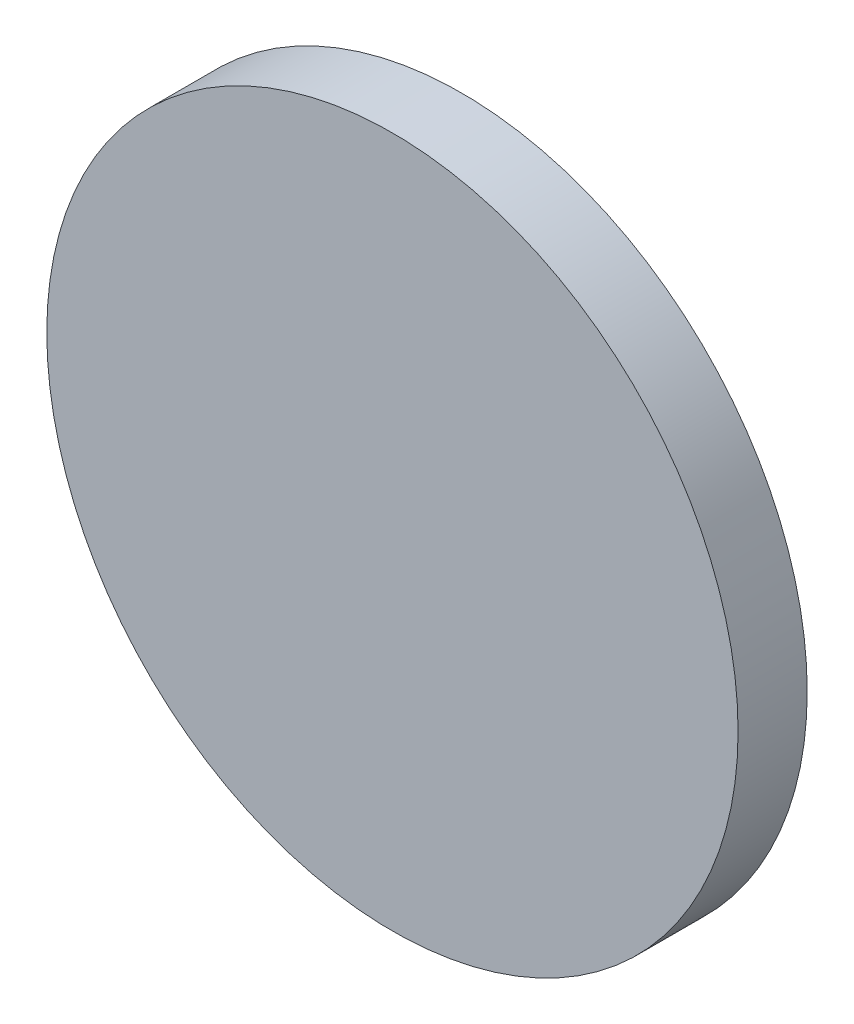
ISO-10303-21;
HEADER;
FILE_DESCRIPTION(('STEP AP214'),'2;1');
FILE_NAME('part.step','',(''),(''),'','','');
FILE_SCHEMA(('AUTOMOTIVE_DESIGN { 1 0 10303 214 1 1 1 1 }'));
ENDSEC;
DATA;
#1=APPLICATION_CONTEXT('core data for automotive mechanical design processes');
#2=APPLICATION_PROTOCOL_DEFINITION('international standard','automotive_design',2000,#1);
#3=PRODUCT_CONTEXT('',#1,'mechanical');
#4=PRODUCT('Part','Part','',(#3));
#5=PRODUCT_RELATED_PRODUCT_CATEGORY('part','',(#4));
#6=PRODUCT_DEFINITION_FORMATION('','',#4);
#7=PRODUCT_DEFINITION_CONTEXT('part definition',#1,'design');
#8=PRODUCT_DEFINITION('design','',#6,#7);
#9=PRODUCT_DEFINITION_SHAPE('','',#8);
#10=(LENGTH_UNIT() NAMED_UNIT(*) SI_UNIT(.MILLI.,.METRE.));
#11=(NAMED_UNIT(*) PLANE_ANGLE_UNIT() SI_UNIT($,.RADIAN.));
#12=(NAMED_UNIT(*) SI_UNIT($,.STERADIAN.) SOLID_ANGLE_UNIT());
#13=UNCERTAINTY_MEASURE_WITH_UNIT(LENGTH_MEASURE(1.E-05),#10,'distance_accuracy_value','');
#14=(GEOMETRIC_REPRESENTATION_CONTEXT(3) GLOBAL_UNCERTAINTY_ASSIGNED_CONTEXT((#13)) GLOBAL_UNIT_ASSIGNED_CONTEXT((#10,
#11,#12)) REPRESENTATION_CONTEXT('',''));
#15=CARTESIAN_POINT('',(0.,0.,0.));
#16=DIRECTION('',(0.,0.,1.));
#17=DIRECTION('',(1.,0.,0.));
#18=AXIS2_PLACEMENT_3D('',#15,#16,#17);
#19=CARTESIAN_POINT('',(0.,0.,3.));
#20=DIRECTION('',(0.,0.,-1.));
#21=DIRECTION('',(-1.,0.,0.));
#22=AXIS2_PLACEMENT_3D('',#19,#20,#21);
#23=CYLINDRICAL_SURFACE('',#22,15.);
#24=CARTESIAN_POINT('',(0.,0.,3.));
#25=DIRECTION('',(0.,0.,1.));
#26=DIRECTION('',(1.,0.,0.));
#27=AXIS2_PLACEMENT_3D('',#24,#25,#26);
#28=CIRCLE('',#27,15.);
#29=CARTESIAN_POINT('',(15.,0.,3.));
#30=VERTEX_POINT('',#29);
#31=EDGE_CURVE('E10',#30,#30,#28,.T.);
#32=ORIENTED_EDGE('',*,*,#31,.F.);
#33=EDGE_LOOP('',(#32));
#34=FACE_BOUND('',#33,.T.);
#35=CARTESIAN_POINT('',(0.,0.,0.));
#36=DIRECTION('',(0.,0.,1.));
#37=DIRECTION('',(1.,0.,0.));
#38=AXIS2_PLACEMENT_3D('',#35,#36,#37);
#39=CIRCLE('',#38,15.);
#40=CARTESIAN_POINT('',(15.,0.,0.));
#41=VERTEX_POINT('',#40);
#42=EDGE_CURVE('E36',#41,#41,#39,.T.);
#43=ORIENTED_EDGE('',*,*,#42,.T.);
#44=EDGE_LOOP('',(#43));
#45=FACE_BOUND('',#44,.T.);
#46=ADVANCED_FACE('F33',(#34,#45),#23,.T.);
#47=CARTESIAN_POINT('',(0.,0.,3.));
#48=DIRECTION('',(0.,0.,1.));
#49=DIRECTION('',(1.,0.,0.));
#50=AXIS2_PLACEMENT_3D('',#47,#48,#49);
#51=PLANE('',#50);
#52=ORIENTED_EDGE('',*,*,#31,.T.);
#53=EDGE_LOOP('',(#52));
#54=FACE_BOUND('',#53,.T.);
#55=ADVANCED_FACE('F48',(#54),#51,.T.);
#56=CARTESIAN_POINT('',(0.,0.,0.));
#57=DIRECTION('',(0.,0.,1.));
#58=DIRECTION('',(1.,0.,0.));
#59=AXIS2_PLACEMENT_3D('',#56,#57,#58);
#60=PLANE('',#59);
#61=ORIENTED_EDGE('',*,*,#42,.F.);
#62=EDGE_LOOP('',(#61));
#63=FACE_BOUND('',#62,.T.);
#64=ADVANCED_FACE('F46',(#63),#60,.F.);
#65=CLOSED_SHELL('',(#46,#55,#64));
#66=MANIFOLD_SOLID_BREP('B2',#65);
#67=ADVANCED_BREP_SHAPE_REPRESENTATION('',(#18,#66),#14);
#68=SHAPE_DEFINITION_REPRESENTATION(#9,#67);
ENDSEC;
END-ISO-10303-21;
